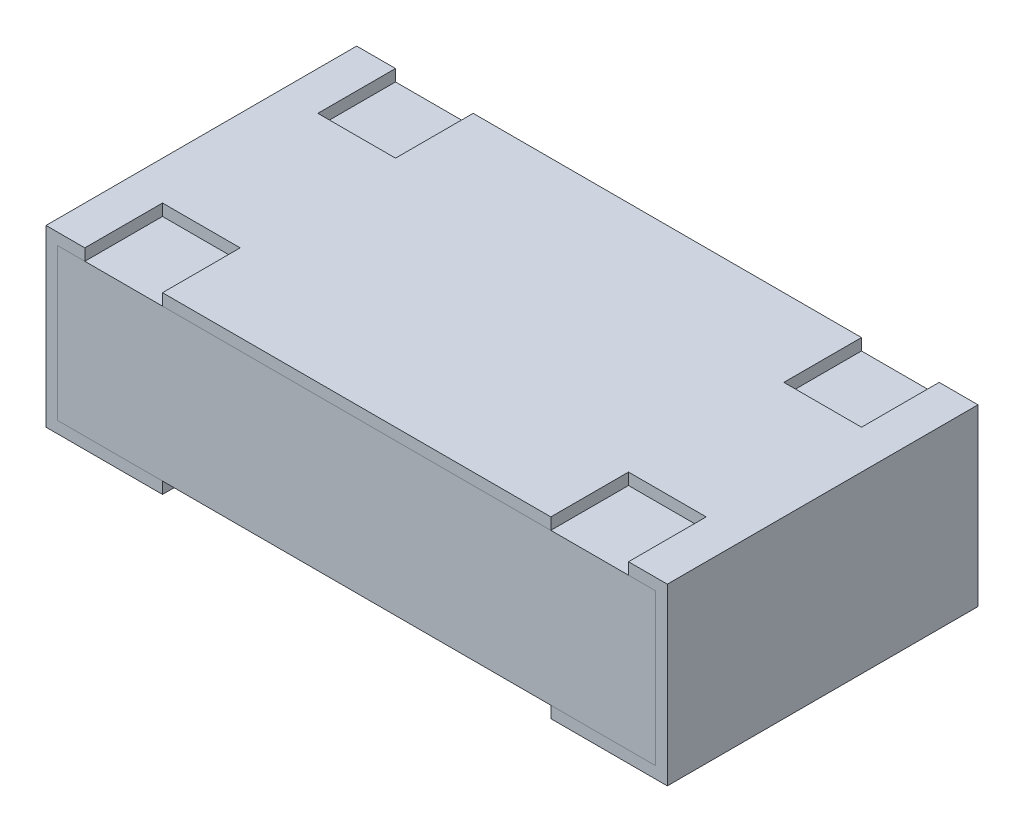
ISO-10303-21;
HEADER;
FILE_DESCRIPTION(('STEP AP214'),'2;1');
FILE_NAME('part.step','',(''),(''),'','','');
FILE_SCHEMA(('AUTOMOTIVE_DESIGN { 1 0 10303 214 1 1 1 1 }'));
ENDSEC;
DATA;
#1=APPLICATION_CONTEXT('core data for automotive mechanical design processes');
#2=APPLICATION_PROTOCOL_DEFINITION('international standard','automotive_design',2000,#1);
#3=PRODUCT_CONTEXT('',#1,'mechanical');
#4=PRODUCT('Part','Part','',(#3));
#5=PRODUCT_RELATED_PRODUCT_CATEGORY('part','',(#4));
#6=PRODUCT_DEFINITION_FORMATION('','',#4);
#7=PRODUCT_DEFINITION_CONTEXT('part definition',#1,'design');
#8=PRODUCT_DEFINITION('design','',#6,#7);
#9=PRODUCT_DEFINITION_SHAPE('','',#8);
#10=(LENGTH_UNIT() NAMED_UNIT(*) SI_UNIT(.MILLI.,.METRE.));
#11=(NAMED_UNIT(*) PLANE_ANGLE_UNIT() SI_UNIT($,.RADIAN.));
#12=(NAMED_UNIT(*) SI_UNIT($,.STERADIAN.) SOLID_ANGLE_UNIT());
#13=UNCERTAINTY_MEASURE_WITH_UNIT(LENGTH_MEASURE(1.E-05),#10,'distance_accuracy_value','');
#14=(GEOMETRIC_REPRESENTATION_CONTEXT(3) GLOBAL_UNCERTAINTY_ASSIGNED_CONTEXT((#13)) GLOBAL_UNIT_ASSIGNED_CONTEXT((#10,
#11,#12)) REPRESENTATION_CONTEXT('',''));
#15=CARTESIAN_POINT('',(0.,0.,0.));
#16=DIRECTION('',(0.,0.,1.));
#17=DIRECTION('',(1.,0.,0.));
#18=AXIS2_PLACEMENT_3D('',#15,#16,#17);
#19=CARTESIAN_POINT('',(0.77,0.42,0.));
#20=DIRECTION('',(0.,0.,1.));
#21=DIRECTION('',(1.,0.,0.));
#22=AXIS2_PLACEMENT_3D('',#19,#20,#21);
#23=PLANE('',#22);
#24=DIRECTION('',(0.,1.,0.));
#25=VECTOR('',#24,1.);
#26=CARTESIAN_POINT('',(0.77,0.03,0.));
#27=LINE('',#26,#25);
#28=CARTESIAN_POINT('',(0.77,0.03,0.));
#29=VERTEX_POINT('',#28);
#30=CARTESIAN_POINT('',(0.77,0.42,0.));
#31=VERTEX_POINT('',#30);
#32=EDGE_CURVE('P0_E93',#29,#31,#27,.T.);
#33=ORIENTED_EDGE('',*,*,#32,.F.);
#34=DIRECTION('',(1.,0.,0.));
#35=VECTOR('',#34,1.);
#36=CARTESIAN_POINT('',(0.77,0.03,0.));
#37=LINE('',#36,#35);
#38=CARTESIAN_POINT('',(-0.77,0.03,0.));
#39=VERTEX_POINT('',#38);
#40=EDGE_CURVE('P0_E20',#39,#29,#37,.T.);
#41=ORIENTED_EDGE('',*,*,#40,.F.);
#42=DIRECTION('',(0.,-1.,0.));
#43=VECTOR('',#42,1.);
#44=CARTESIAN_POINT('',(-0.77,0.03,0.));
#45=LINE('',#44,#43);
#46=CARTESIAN_POINT('',(-0.77,0.42,0.));
#47=VERTEX_POINT('',#46);
#48=EDGE_CURVE('P0_E82',#47,#39,#45,.T.);
#49=ORIENTED_EDGE('',*,*,#48,.F.);
#50=DIRECTION('',(-1.,0.,0.));
#51=VECTOR('',#50,1.);
#52=CARTESIAN_POINT('',(0.77,0.42,0.));
#53=LINE('',#52,#51);
#54=EDGE_CURVE('P0_E104',#31,#47,#53,.T.);
#55=ORIENTED_EDGE('',*,*,#54,.F.);
#56=EDGE_LOOP('',(#33,#41,#49,#55));
#57=FACE_BOUND('',#56,.T.);
#58=ADVANCED_FACE('P0_F17',(#57),#23,.F.);
#59=CARTESIAN_POINT('',(0.77,0.42,0.8));
#60=DIRECTION('',(0.,0.,1.));
#61=DIRECTION('',(1.,0.,0.));
#62=AXIS2_PLACEMENT_3D('',#59,#60,#61);
#63=PLANE('',#62);
#64=DIRECTION('',(0.,1.,0.));
#65=VECTOR('',#64,1.);
#66=CARTESIAN_POINT('',(0.77,0.03,0.8));
#67=LINE('',#66,#65);
#68=CARTESIAN_POINT('',(0.77,0.03,0.8));
#69=VERTEX_POINT('',#68);
#70=CARTESIAN_POINT('',(0.77,0.42,0.8));
#71=VERTEX_POINT('',#70);
#72=EDGE_CURVE('P0_E85',#69,#71,#67,.T.);
#73=ORIENTED_EDGE('',*,*,#72,.T.);
#74=DIRECTION('',(-1.,0.,0.));
#75=VECTOR('',#74,1.);
#76=CARTESIAN_POINT('',(0.77,0.42,0.8));
#77=LINE('',#76,#75);
#78=CARTESIAN_POINT('',(-0.77,0.42,0.8));
#79=VERTEX_POINT('',#78);
#80=EDGE_CURVE('P0_E71',#71,#79,#77,.T.);
#81=ORIENTED_EDGE('',*,*,#80,.T.);
#82=DIRECTION('',(0.,-1.,0.));
#83=VECTOR('',#82,1.);
#84=CARTESIAN_POINT('',(-0.77,0.03,0.8));
#85=LINE('',#84,#83);
#86=CARTESIAN_POINT('',(-0.77,0.03,0.8));
#87=VERTEX_POINT('',#86);
#88=EDGE_CURVE('P0_E113',#79,#87,#85,.T.);
#89=ORIENTED_EDGE('',*,*,#88,.T.);
#90=DIRECTION('',(1.,0.,0.));
#91=VECTOR('',#90,1.);
#92=CARTESIAN_POINT('',(0.77,0.03,0.8));
#93=LINE('',#92,#91);
#94=EDGE_CURVE('P0_E11',#87,#69,#93,.T.);
#95=ORIENTED_EDGE('',*,*,#94,.T.);
#96=EDGE_LOOP('',(#73,#81,#89,#95));
#97=FACE_BOUND('',#96,.T.);
#98=ADVANCED_FACE('P0_F86',(#97),#63,.T.);
#99=CARTESIAN_POINT('',(0.77,0.03,0.8));
#100=DIRECTION('',(0.,1.,0.));
#101=DIRECTION('',(1.,0.,0.));
#102=AXIS2_PLACEMENT_3D('',#99,#100,#101);
#103=PLANE('',#102);
#104=ORIENTED_EDGE('',*,*,#40,.T.);
#105=DIRECTION('',(0.,0.,-1.));
#106=VECTOR('',#105,1.);
#107=CARTESIAN_POINT('',(0.77,0.03,0.8));
#108=LINE('',#107,#106);
#109=EDGE_CURVE('P0_E90',#69,#29,#108,.T.);
#110=ORIENTED_EDGE('',*,*,#109,.F.);
#111=ORIENTED_EDGE('',*,*,#94,.F.);
#112=DIRECTION('',(0.,0.,-1.));
#113=VECTOR('',#112,1.);
#114=CARTESIAN_POINT('',(-0.77,0.03,0.8));
#115=LINE('',#114,#113);
#116=EDGE_CURVE('P0_E112',#87,#39,#115,.T.);
#117=ORIENTED_EDGE('',*,*,#116,.T.);
#118=EDGE_LOOP('',(#104,#110,#111,#117));
#119=FACE_BOUND('',#118,.T.);
#120=ADVANCED_FACE('P0_F119',(#119),#103,.F.);
#121=CARTESIAN_POINT('',(-0.77,0.03,0.8));
#122=DIRECTION('',(1.,0.,0.));
#123=DIRECTION('',(0.,1.,0.));
#124=AXIS2_PLACEMENT_3D('',#121,#122,#123);
#125=PLANE('',#124);
#126=ORIENTED_EDGE('',*,*,#48,.T.);
#127=ORIENTED_EDGE('',*,*,#116,.F.);
#128=ORIENTED_EDGE('',*,*,#88,.F.);
#129=DIRECTION('',(0.,0.,-1.));
#130=VECTOR('',#129,1.);
#131=CARTESIAN_POINT('',(-0.77,0.42,0.8));
#132=LINE('',#131,#130);
#133=EDGE_CURVE('P0_E79',#79,#47,#132,.T.);
#134=ORIENTED_EDGE('',*,*,#133,.T.);
#135=EDGE_LOOP('',(#126,#127,#128,#134));
#136=FACE_BOUND('',#135,.T.);
#137=ADVANCED_FACE('P0_F121',(#136),#125,.F.);
#138=CARTESIAN_POINT('',(0.77,0.42,0.8));
#139=DIRECTION('',(0.,-1.,0.));
#140=DIRECTION('',(0.,0.,-1.));
#141=AXIS2_PLACEMENT_3D('',#138,#139,#140);
#142=PLANE('',#141);
#143=ORIENTED_EDGE('',*,*,#54,.T.);
#144=ORIENTED_EDGE('',*,*,#133,.F.);
#145=ORIENTED_EDGE('',*,*,#80,.F.);
#146=DIRECTION('',(0.,0.,-1.));
#147=VECTOR('',#146,1.);
#148=CARTESIAN_POINT('',(0.77,0.42,0.8));
#149=LINE('',#148,#147);
#150=EDGE_CURVE('P0_E76',#71,#31,#149,.T.);
#151=ORIENTED_EDGE('',*,*,#150,.T.);
#152=EDGE_LOOP('',(#143,#144,#145,#151));
#153=FACE_BOUND('',#152,.T.);
#154=ADVANCED_FACE('P0_F74',(#153),#142,.F.);
#155=CARTESIAN_POINT('',(0.77,0.03,0.8));
#156=DIRECTION('',(-1.,0.,0.));
#157=DIRECTION('',(0.,0.,1.));
#158=AXIS2_PLACEMENT_3D('',#155,#156,#157);
#159=PLANE('',#158);
#160=ORIENTED_EDGE('',*,*,#32,.T.);
#161=ORIENTED_EDGE('',*,*,#150,.F.);
#162=ORIENTED_EDGE('',*,*,#72,.F.);
#163=ORIENTED_EDGE('',*,*,#109,.T.);
#164=EDGE_LOOP('',(#160,#161,#162,#163));
#165=FACE_BOUND('',#164,.T.);
#166=ADVANCED_FACE('P0_F92',(#165),#159,.F.);
#167=CLOSED_SHELL('',(#58,#98,#120,#137,#154,#166));
#168=MANIFOLD_SOLID_BREP('P0_B1',#167);
#169=CARTESIAN_POINT('',(0.7,0.42,0.6));
#170=DIRECTION('',(1.,0.,0.));
#171=DIRECTION('',(0.,1.,0.));
#172=AXIS2_PLACEMENT_3D('',#169,#170,#171);
#173=PLANE('',#172);
#174=DIRECTION('',(0.,0.,-1.));
#175=VECTOR('',#174,1.);
#176=CARTESIAN_POINT('',(0.7,0.45,0.6));
#177=LINE('',#176,#175);
#178=CARTESIAN_POINT('',(0.7,0.45,0.8));
#179=VERTEX_POINT('',#178);
#180=CARTESIAN_POINT('',(0.7,0.45,0.6));
#181=VERTEX_POINT('',#180);
#182=EDGE_CURVE('P1_E400',#179,#181,#177,.T.);
#183=ORIENTED_EDGE('',*,*,#182,.T.);
#184=DIRECTION('',(0.,1.,0.));
#185=VECTOR('',#184,1.);
#186=CARTESIAN_POINT('',(0.7,0.42,0.6));
#187=LINE('',#186,#185);
#188=CARTESIAN_POINT('',(0.7,0.42,0.6));
#189=VERTEX_POINT('',#188);
#190=EDGE_CURVE('P1_E11',#189,#181,#187,.T.);
#191=ORIENTED_EDGE('',*,*,#190,.F.);
#192=DIRECTION('',(0.,0.,-1.));
#193=VECTOR('',#192,1.);
#194=CARTESIAN_POINT('',(0.7,0.42,0.6));
#195=LINE('',#194,#193);
#196=CARTESIAN_POINT('',(0.7,0.42,0.8));
#197=VERTEX_POINT('',#196);
#198=EDGE_CURVE('P1_E347',#197,#189,#195,.T.);
#199=ORIENTED_EDGE('',*,*,#198,.F.);
#200=DIRECTION('',(0.,1.,0.));
#201=VECTOR('',#200,1.);
#202=CARTESIAN_POINT('',(0.7,0.42,0.8));
#203=LINE('',#202,#201);
#204=EDGE_CURVE('P1_E38',#197,#179,#203,.T.);
#205=ORIENTED_EDGE('',*,*,#204,.T.);
#206=EDGE_LOOP('',(#183,#191,#199,#205));
#207=FACE_BOUND('',#206,.T.);
#208=ADVANCED_FACE('P1_F17',(#207),#173,.F.);
#209=CARTESIAN_POINT('',(0.5,0.42,0.6));
#210=DIRECTION('',(0.,0.,-1.));
#211=DIRECTION('',(0.,-1.,0.));
#212=AXIS2_PLACEMENT_3D('',#209,#210,#211);
#213=PLANE('',#212);
#214=DIRECTION('',(-1.,0.,0.));
#215=VECTOR('',#214,1.);
#216=CARTESIAN_POINT('',(0.5,0.45,0.6));
#217=LINE('',#216,#215);
#218=CARTESIAN_POINT('',(0.5,0.45,0.6));
#219=VERTEX_POINT('',#218);
#220=EDGE_CURVE('P1_E396',#181,#219,#217,.T.);
#221=ORIENTED_EDGE('',*,*,#220,.T.);
#222=DIRECTION('',(0.,1.,0.));
#223=VECTOR('',#222,1.);
#224=CARTESIAN_POINT('',(0.5,0.42,0.6));
#225=LINE('',#224,#223);
#226=CARTESIAN_POINT('',(0.5,0.42,0.6));
#227=VERTEX_POINT('',#226);
#228=EDGE_CURVE('P1_E26',#227,#219,#225,.T.);
#229=ORIENTED_EDGE('',*,*,#228,.F.);
#230=DIRECTION('',(-1.,0.,0.));
#231=VECTOR('',#230,1.);
#232=CARTESIAN_POINT('',(0.5,0.42,0.6));
#233=LINE('',#232,#231);
#234=EDGE_CURVE('P1_E352',#189,#227,#233,.T.);
#235=ORIENTED_EDGE('',*,*,#234,.F.);
#236=ORIENTED_EDGE('',*,*,#190,.T.);
#237=EDGE_LOOP('',(#221,#229,#235,#236));
#238=FACE_BOUND('',#237,.T.);
#239=ADVANCED_FACE('P1_F438',(#238),#213,.F.);
#240=CARTESIAN_POINT('',(0.5,0.42,0.8));
#241=DIRECTION('',(-1.,0.,0.));
#242=DIRECTION('',(0.,0.,1.));
#243=AXIS2_PLACEMENT_3D('',#240,#241,#242);
#244=PLANE('',#243);
#245=DIRECTION('',(0.,0.,1.));
#246=VECTOR('',#245,1.);
#247=CARTESIAN_POINT('',(0.5,0.45,0.8));
#248=LINE('',#247,#246);
#249=CARTESIAN_POINT('',(0.5,0.45,0.8));
#250=VERTEX_POINT('',#249);
#251=EDGE_CURVE('P1_E433',#219,#250,#248,.T.);
#252=ORIENTED_EDGE('',*,*,#251,.T.);
#253=DIRECTION('',(0.,1.,0.));
#254=VECTOR('',#253,1.);
#255=CARTESIAN_POINT('',(0.5,0.42,0.8));
#256=LINE('',#255,#254);
#257=CARTESIAN_POINT('',(0.5,0.42,0.8));
#258=VERTEX_POINT('',#257);
#259=EDGE_CURVE('P1_E516',#258,#250,#256,.T.);
#260=ORIENTED_EDGE('',*,*,#259,.F.);
#261=DIRECTION('',(0.,0.,1.));
#262=VECTOR('',#261,1.);
#263=CARTESIAN_POINT('',(0.5,0.42,0.8));
#264=LINE('',#263,#262);
#265=EDGE_CURVE('P1_E356',#227,#258,#264,.T.);
#266=ORIENTED_EDGE('',*,*,#265,.F.);
#267=ORIENTED_EDGE('',*,*,#228,.T.);
#268=EDGE_LOOP('',(#252,#260,#266,#267));
#269=FACE_BOUND('',#268,.T.);
#270=ADVANCED_FACE('P1_F430',(#269),#244,.F.);
#271=CARTESIAN_POINT('',(-0.5,0.42,0.8));
#272=DIRECTION('',(1.,0.,0.));
#273=DIRECTION('',(0.,1.,0.));
#274=AXIS2_PLACEMENT_3D('',#271,#272,#273);
#275=PLANE('',#274);
#276=DIRECTION('',(0.,0.,-1.));
#277=VECTOR('',#276,1.);
#278=CARTESIAN_POINT('',(-0.5,0.45,0.8));
#279=LINE('',#278,#277);
#280=CARTESIAN_POINT('',(-0.5,0.45,0.8));
#281=VERTEX_POINT('',#280);
#282=CARTESIAN_POINT('',(-0.5,0.45,0.6));
#283=VERTEX_POINT('',#282);
#284=EDGE_CURVE('P1_E455',#281,#283,#279,.T.);
#285=ORIENTED_EDGE('',*,*,#284,.T.);
#286=DIRECTION('',(0.,1.,0.));
#287=VECTOR('',#286,1.);
#288=CARTESIAN_POINT('',(-0.5,0.42,0.6));
#289=LINE('',#288,#287);
#290=CARTESIAN_POINT('',(-0.5,0.42,0.6));
#291=VERTEX_POINT('',#290);
#292=EDGE_CURVE('P1_E422',#291,#283,#289,.T.);
#293=ORIENTED_EDGE('',*,*,#292,.F.);
#294=DIRECTION('',(0.,0.,-1.));
#295=VECTOR('',#294,1.);
#296=CARTESIAN_POINT('',(-0.5,0.42,0.8));
#297=LINE('',#296,#295);
#298=CARTESIAN_POINT('',(-0.5,0.42,0.8));
#299=VERTEX_POINT('',#298);
#300=EDGE_CURVE('P1_E359',#299,#291,#297,.T.);
#301=ORIENTED_EDGE('',*,*,#300,.F.);
#302=DIRECTION('',(0.,1.,0.));
#303=VECTOR('',#302,1.);
#304=CARTESIAN_POINT('',(-0.5,0.42,0.8));
#305=LINE('',#304,#303);
#306=EDGE_CURVE('P1_E519',#299,#281,#305,.T.);
#307=ORIENTED_EDGE('',*,*,#306,.T.);
#308=EDGE_LOOP('',(#285,#293,#301,#307));
#309=FACE_BOUND('',#308,.T.);
#310=ADVANCED_FACE('P1_F651',(#309),#275,.F.);
#311=CARTESIAN_POINT('',(-0.5,0.42,0.6));
#312=DIRECTION('',(0.,0.,-1.));
#313=DIRECTION('',(0.,-1.,0.));
#314=AXIS2_PLACEMENT_3D('',#311,#312,#313);
#315=PLANE('',#314);
#316=DIRECTION('',(-1.,0.,0.));
#317=VECTOR('',#316,1.);
#318=CARTESIAN_POINT('',(-0.5,0.45,0.6));
#319=LINE('',#318,#317);
#320=CARTESIAN_POINT('',(-0.7,0.45,0.6));
#321=VERTEX_POINT('',#320);
#322=EDGE_CURVE('P1_E475',#283,#321,#319,.T.);
#323=ORIENTED_EDGE('',*,*,#322,.T.);
#324=DIRECTION('',(0.,1.,0.));
#325=VECTOR('',#324,1.);
#326=CARTESIAN_POINT('',(-0.7,0.42,0.6));
#327=LINE('',#326,#325);
#328=CARTESIAN_POINT('',(-0.7,0.42,0.6));
#329=VERTEX_POINT('',#328);
#330=EDGE_CURVE('P1_E421',#329,#321,#327,.T.);
#331=ORIENTED_EDGE('',*,*,#330,.F.);
#332=DIRECTION('',(-1.,0.,0.));
#333=VECTOR('',#332,1.);
#334=CARTESIAN_POINT('',(-0.5,0.42,0.6));
#335=LINE('',#334,#333);
#336=EDGE_CURVE('P1_E363',#291,#329,#335,.T.);
#337=ORIENTED_EDGE('',*,*,#336,.F.);
#338=ORIENTED_EDGE('',*,*,#292,.T.);
#339=EDGE_LOOP('',(#323,#331,#337,#338));
#340=FACE_BOUND('',#339,.T.);
#341=ADVANCED_FACE('P1_F649',(#340),#315,.F.);
#342=CARTESIAN_POINT('',(-0.7,0.42,0.6));
#343=DIRECTION('',(-1.,0.,0.));
#344=DIRECTION('',(0.,0.,1.));
#345=AXIS2_PLACEMENT_3D('',#342,#343,#344);
#346=PLANE('',#345);
#347=DIRECTION('',(0.,0.,1.));
#348=VECTOR('',#347,1.);
#349=CARTESIAN_POINT('',(-0.7,0.45,0.6));
#350=LINE('',#349,#348);
#351=CARTESIAN_POINT('',(-0.7,0.45,0.8));
#352=VERTEX_POINT('',#351);
#353=EDGE_CURVE('P1_E472',#321,#352,#350,.T.);
#354=ORIENTED_EDGE('',*,*,#353,.T.);
#355=DIRECTION('',(0.,1.,0.));
#356=VECTOR('',#355,1.);
#357=CARTESIAN_POINT('',(-0.7,0.42,0.8));
#358=LINE('',#357,#356);
#359=CARTESIAN_POINT('',(-0.7,0.42,0.8));
#360=VERTEX_POINT('',#359);
#361=EDGE_CURVE('P1_E505',#360,#352,#358,.T.);
#362=ORIENTED_EDGE('',*,*,#361,.F.);
#363=DIRECTION('',(0.,0.,1.));
#364=VECTOR('',#363,1.);
#365=CARTESIAN_POINT('',(-0.7,0.42,0.6));
#366=LINE('',#365,#364);
#367=EDGE_CURVE('P1_E489',#329,#360,#366,.T.);
#368=ORIENTED_EDGE('',*,*,#367,.F.);
#369=ORIENTED_EDGE('',*,*,#330,.T.);
#370=EDGE_LOOP('',(#354,#362,#368,#369));
#371=FACE_BOUND('',#370,.T.);
#372=ADVANCED_FACE('P1_F646',(#371),#346,.F.);
#373=CARTESIAN_POINT('',(-0.7,0.42,0.2));
#374=DIRECTION('',(-1.,0.,0.));
#375=DIRECTION('',(0.,0.,1.));
#376=AXIS2_PLACEMENT_3D('',#373,#374,#375);
#377=PLANE('',#376);
#378=DIRECTION('',(0.,0.,1.));
#379=VECTOR('',#378,1.);
#380=CARTESIAN_POINT('',(-0.7,0.45,0.2));
#381=LINE('',#380,#379);
#382=CARTESIAN_POINT('',(-0.7,0.45,0.));
#383=VERTEX_POINT('',#382);
#384=CARTESIAN_POINT('',(-0.7,0.45,0.2));
#385=VERTEX_POINT('',#384);
#386=EDGE_CURVE('P1_E453',#383,#385,#381,.T.);
#387=ORIENTED_EDGE('',*,*,#386,.T.);
#388=DIRECTION('',(0.,1.,0.));
#389=VECTOR('',#388,1.);
#390=CARTESIAN_POINT('',(-0.7,0.42,0.2));
#391=LINE('',#390,#389);
#392=CARTESIAN_POINT('',(-0.7,0.42,0.2));
#393=VERTEX_POINT('',#392);
#394=EDGE_CURVE('P1_E418',#393,#385,#391,.T.);
#395=ORIENTED_EDGE('',*,*,#394,.F.);
#396=DIRECTION('',(0.,0.,1.));
#397=VECTOR('',#396,1.);
#398=CARTESIAN_POINT('',(-0.7,0.42,0.2));
#399=LINE('',#398,#397);
#400=CARTESIAN_POINT('',(-0.7,0.42,0.));
#401=VERTEX_POINT('',#400);
#402=EDGE_CURVE('P1_E364',#401,#393,#399,.T.);
#403=ORIENTED_EDGE('',*,*,#402,.F.);
#404=DIRECTION('',(0.,1.,0.));
#405=VECTOR('',#404,1.);
#406=CARTESIAN_POINT('',(-0.7,0.42,0.));
#407=LINE('',#406,#405);
#408=EDGE_CURVE('P1_E407',#401,#383,#407,.T.);
#409=ORIENTED_EDGE('',*,*,#408,.T.);
#410=EDGE_LOOP('',(#387,#395,#403,#409));
#411=FACE_BOUND('',#410,.T.);
#412=ADVANCED_FACE('P1_F640',(#411),#377,.F.);
#413=CARTESIAN_POINT('',(-0.5,0.42,0.2));
#414=DIRECTION('',(0.,0.,1.));
#415=DIRECTION('',(1.,0.,0.));
#416=AXIS2_PLACEMENT_3D('',#413,#414,#415);
#417=PLANE('',#416);
#418=DIRECTION('',(1.,0.,0.));
#419=VECTOR('',#418,1.);
#420=CARTESIAN_POINT('',(-0.5,0.45,0.2));
#421=LINE('',#420,#419);
#422=CARTESIAN_POINT('',(-0.5,0.45,0.2));
#423=VERTEX_POINT('',#422);
#424=EDGE_CURVE('P1_E446',#385,#423,#421,.T.);
#425=ORIENTED_EDGE('',*,*,#424,.T.);
#426=DIRECTION('',(0.,1.,0.));
#427=VECTOR('',#426,1.);
#428=CARTESIAN_POINT('',(-0.5,0.42,0.2));
#429=LINE('',#428,#427);
#430=CARTESIAN_POINT('',(-0.5,0.42,0.2));
#431=VERTEX_POINT('',#430);
#432=EDGE_CURVE('P1_E417',#431,#423,#429,.T.);
#433=ORIENTED_EDGE('',*,*,#432,.F.);
#434=DIRECTION('',(1.,0.,0.));
#435=VECTOR('',#434,1.);
#436=CARTESIAN_POINT('',(-0.5,0.42,0.2));
#437=LINE('',#436,#435);
#438=EDGE_CURVE('P1_E338',#393,#431,#437,.T.);
#439=ORIENTED_EDGE('',*,*,#438,.F.);
#440=ORIENTED_EDGE('',*,*,#394,.T.);
#441=EDGE_LOOP('',(#425,#433,#439,#440));
#442=FACE_BOUND('',#441,.T.);
#443=ADVANCED_FACE('P1_F627',(#442),#417,.F.);
#444=CARTESIAN_POINT('',(-0.5,0.42,0.));
#445=DIRECTION('',(1.,0.,0.));
#446=DIRECTION('',(0.,1.,0.));
#447=AXIS2_PLACEMENT_3D('',#444,#445,#446);
#448=PLANE('',#447);
#449=DIRECTION('',(0.,0.,-1.));
#450=VECTOR('',#449,1.);
#451=CARTESIAN_POINT('',(-0.5,0.45,0.));
#452=LINE('',#451,#450);
#453=CARTESIAN_POINT('',(-0.5,0.45,0.));
#454=VERTEX_POINT('',#453);
#455=EDGE_CURVE('P1_E468',#423,#454,#452,.T.);
#456=ORIENTED_EDGE('',*,*,#455,.T.);
#457=DIRECTION('',(0.,1.,0.));
#458=VECTOR('',#457,1.);
#459=CARTESIAN_POINT('',(-0.5,0.42,0.));
#460=LINE('',#459,#458);
#461=CARTESIAN_POINT('',(-0.5,0.42,0.));
#462=VERTEX_POINT('',#461);
#463=EDGE_CURVE('P1_E306',#462,#454,#460,.T.);
#464=ORIENTED_EDGE('',*,*,#463,.F.);
#465=DIRECTION('',(0.,0.,-1.));
#466=VECTOR('',#465,1.);
#467=CARTESIAN_POINT('',(-0.5,0.42,0.));
#468=LINE('',#467,#466);
#469=EDGE_CURVE('P1_E316',#431,#462,#468,.T.);
#470=ORIENTED_EDGE('',*,*,#469,.F.);
#471=ORIENTED_EDGE('',*,*,#432,.T.);
#472=EDGE_LOOP('',(#456,#464,#470,#471));
#473=FACE_BOUND('',#472,.T.);
#474=ADVANCED_FACE('P1_F621',(#473),#448,.F.);
#475=CARTESIAN_POINT('',(0.5,0.42,0.));
#476=DIRECTION('',(-1.,0.,0.));
#477=DIRECTION('',(0.,0.,1.));
#478=AXIS2_PLACEMENT_3D('',#475,#476,#477);
#479=PLANE('',#478);
#480=DIRECTION('',(0.,0.,1.));
#481=VECTOR('',#480,1.);
#482=CARTESIAN_POINT('',(0.5,0.45,0.));
#483=LINE('',#482,#481);
#484=CARTESIAN_POINT('',(0.5,0.45,0.));
#485=VERTEX_POINT('',#484);
#486=CARTESIAN_POINT('',(0.5,0.45,0.2));
#487=VERTEX_POINT('',#486);
#488=EDGE_CURVE('P1_E460',#485,#487,#483,.T.);
#489=ORIENTED_EDGE('',*,*,#488,.T.);
#490=DIRECTION('',(0.,1.,0.));
#491=VECTOR('',#490,1.);
#492=CARTESIAN_POINT('',(0.5,0.42,0.2));
#493=LINE('',#492,#491);
#494=CARTESIAN_POINT('',(0.5,0.42,0.2));
#495=VERTEX_POINT('',#494);
#496=EDGE_CURVE('P1_E414',#495,#487,#493,.T.);
#497=ORIENTED_EDGE('',*,*,#496,.F.);
#498=DIRECTION('',(0.,0.,1.));
#499=VECTOR('',#498,1.);
#500=CARTESIAN_POINT('',(0.5,0.42,0.));
#501=LINE('',#500,#499);
#502=CARTESIAN_POINT('',(0.5,0.42,0.));
#503=VERTEX_POINT('',#502);
#504=EDGE_CURVE('P1_E312',#503,#495,#501,.T.);
#505=ORIENTED_EDGE('',*,*,#504,.F.);
#506=DIRECTION('',(0.,1.,0.));
#507=VECTOR('',#506,1.);
#508=CARTESIAN_POINT('',(0.5,0.42,0.));
#509=LINE('',#508,#507);
#510=EDGE_CURVE('P1_E302',#503,#485,#509,.T.);
#511=ORIENTED_EDGE('',*,*,#510,.T.);
#512=EDGE_LOOP('',(#489,#497,#505,#511));
#513=FACE_BOUND('',#512,.T.);
#514=ADVANCED_FACE('P1_F937',(#513),#479,.F.);
#515=CARTESIAN_POINT('',(0.5,0.42,0.2));
#516=DIRECTION('',(0.,0.,1.));
#517=DIRECTION('',(1.,0.,0.));
#518=AXIS2_PLACEMENT_3D('',#515,#516,#517);
#519=PLANE('',#518);
#520=DIRECTION('',(1.,0.,0.));
#521=VECTOR('',#520,1.);
#522=CARTESIAN_POINT('',(0.5,0.45,0.2));
#523=LINE('',#522,#521);
#524=CARTESIAN_POINT('',(0.7,0.45,0.2));
#525=VERTEX_POINT('',#524);
#526=EDGE_CURVE('P1_E392',#487,#525,#523,.T.);
#527=ORIENTED_EDGE('',*,*,#526,.T.);
#528=DIRECTION('',(0.,1.,0.));
#529=VECTOR('',#528,1.);
#530=CARTESIAN_POINT('',(0.7,0.42,0.2));
#531=LINE('',#530,#529);
#532=CARTESIAN_POINT('',(0.7,0.42,0.2));
#533=VERTEX_POINT('',#532);
#534=EDGE_CURVE('P1_E410',#533,#525,#531,.T.);
#535=ORIENTED_EDGE('',*,*,#534,.F.);
#536=DIRECTION('',(1.,0.,0.));
#537=VECTOR('',#536,1.);
#538=CARTESIAN_POINT('',(0.5,0.42,0.2));
#539=LINE('',#538,#537);
#540=EDGE_CURVE('P1_E315',#495,#533,#539,.T.);
#541=ORIENTED_EDGE('',*,*,#540,.F.);
#542=ORIENTED_EDGE('',*,*,#496,.T.);
#543=EDGE_LOOP('',(#527,#535,#541,#542));
#544=FACE_BOUND('',#543,.T.);
#545=ADVANCED_FACE('P1_F932',(#544),#519,.F.);
#546=CARTESIAN_POINT('',(0.7,0.42,0.2));
#547=DIRECTION('',(1.,0.,0.));
#548=DIRECTION('',(0.,1.,0.));
#549=AXIS2_PLACEMENT_3D('',#546,#547,#548);
#550=PLANE('',#549);
#551=DIRECTION('',(0.,0.,-1.));
#552=VECTOR('',#551,1.);
#553=CARTESIAN_POINT('',(0.7,0.45,0.2));
#554=LINE('',#553,#552);
#555=CARTESIAN_POINT('',(0.7,0.45,0.));
#556=VERTEX_POINT('',#555);
#557=EDGE_CURVE('P1_E401',#525,#556,#554,.T.);
#558=ORIENTED_EDGE('',*,*,#557,.T.);
#559=DIRECTION('',(0.,1.,0.));
#560=VECTOR('',#559,1.);
#561=CARTESIAN_POINT('',(0.7,0.42,0.));
#562=LINE('',#561,#560);
#563=CARTESIAN_POINT('',(0.7,0.42,0.));
#564=VERTEX_POINT('',#563);
#565=EDGE_CURVE('P1_E307',#564,#556,#562,.T.);
#566=ORIENTED_EDGE('',*,*,#565,.F.);
#567=DIRECTION('',(0.,0.,-1.));
#568=VECTOR('',#567,1.);
#569=CARTESIAN_POINT('',(0.7,0.42,0.2));
#570=LINE('',#569,#568);
#571=EDGE_CURVE('P1_E526',#533,#564,#570,.T.);
#572=ORIENTED_EDGE('',*,*,#571,.F.);
#573=ORIENTED_EDGE('',*,*,#534,.T.);
#574=EDGE_LOOP('',(#558,#566,#572,#573));
#575=FACE_BOUND('',#574,.T.);
#576=ADVANCED_FACE('P1_F905',(#575),#550,.F.);
#577=CARTESIAN_POINT('',(-0.8,0.45,0.));
#578=DIRECTION('',(0.,0.,1.));
#579=DIRECTION('',(1.,0.,0.));
#580=AXIS2_PLACEMENT_3D('',#577,#578,#579);
#581=PLANE('',#580);
#582=DIRECTION('',(-1.,0.,0.));
#583=VECTOR('',#582,1.);
#584=CARTESIAN_POINT('',(0.,0.45,0.));
#585=LINE('',#584,#583);
#586=CARTESIAN_POINT('',(-0.8,0.45,0.));
#587=VERTEX_POINT('',#586);
#588=EDGE_CURVE('P1_E481',#383,#587,#585,.T.);
#589=ORIENTED_EDGE('',*,*,#588,.F.);
#590=ORIENTED_EDGE('',*,*,#408,.F.);
#591=DIRECTION('',(1.,0.,0.));
#592=VECTOR('',#591,1.);
#593=CARTESIAN_POINT('',(0.,0.42,0.));
#594=LINE('',#593,#592);
#595=CARTESIAN_POINT('',(-0.77,0.42,0.));
#596=VERTEX_POINT('',#595);
#597=EDGE_CURVE('P1_E368',#596,#401,#594,.T.);
#598=ORIENTED_EDGE('',*,*,#597,.F.);
#599=DIRECTION('',(0.,1.,0.));
#600=VECTOR('',#599,1.);
#601=CARTESIAN_POINT('',(-0.77,0.42,0.));
#602=LINE('',#601,#600);
#603=CARTESIAN_POINT('',(-0.77,0.03,0.));
#604=VERTEX_POINT('',#603);
#605=EDGE_CURVE('P1_E339',#604,#596,#602,.T.);
#606=ORIENTED_EDGE('',*,*,#605,.F.);
#607=DIRECTION('',(-1.,0.,0.));
#608=VECTOR('',#607,1.);
#609=CARTESIAN_POINT('',(-0.77,0.03,0.));
#610=LINE('',#609,#608);
#611=CARTESIAN_POINT('',(-0.5,0.03,0.));
#612=VERTEX_POINT('',#611);
#613=EDGE_CURVE('P1_E574',#612,#604,#610,.T.);
#614=ORIENTED_EDGE('',*,*,#613,.F.);
#615=DIRECTION('',(0.,1.,0.));
#616=VECTOR('',#615,1.);
#617=CARTESIAN_POINT('',(-0.5,0.03,0.));
#618=LINE('',#617,#616);
#619=CARTESIAN_POINT('',(-0.5,0.,0.));
#620=VERTEX_POINT('',#619);
#621=EDGE_CURVE('P1_E333',#620,#612,#618,.T.);
#622=ORIENTED_EDGE('',*,*,#621,.F.);
#623=DIRECTION('',(1.,0.,0.));
#624=VECTOR('',#623,1.);
#625=CARTESIAN_POINT('',(-0.8,0.,0.));
#626=LINE('',#625,#624);
#627=CARTESIAN_POINT('',(-0.8,0.,0.));
#628=VERTEX_POINT('',#627);
#629=EDGE_CURVE('P1_E325',#628,#620,#626,.T.);
#630=ORIENTED_EDGE('',*,*,#629,.F.);
#631=DIRECTION('',(0.,-1.,0.));
#632=VECTOR('',#631,1.);
#633=CARTESIAN_POINT('',(-0.8,0.45,0.));
#634=LINE('',#633,#632);
#635=EDGE_CURVE('P1_E320',#587,#628,#634,.T.);
#636=ORIENTED_EDGE('',*,*,#635,.F.);
#637=EDGE_LOOP('',(#589,#590,#598,#606,#614,#622,#630,#636));
#638=FACE_BOUND('',#637,.T.);
#639=ADVANCED_FACE('P1_F592',(#638),#581,.F.);
#640=CARTESIAN_POINT('',(-0.8,0.45,0.8));
#641=DIRECTION('',(0.,0.,1.));
#642=DIRECTION('',(1.,0.,0.));
#643=AXIS2_PLACEMENT_3D('',#640,#641,#642);
#644=PLANE('',#643);
#645=ORIENTED_EDGE('',*,*,#204,.F.);
#646=DIRECTION('',(1.,0.,0.));
#647=VECTOR('',#646,1.);
#648=CARTESIAN_POINT('',(0.,0.42,0.8));
#649=LINE('',#648,#647);
#650=CARTESIAN_POINT('',(0.77,0.42,0.8));
#651=VERTEX_POINT('',#650);
#652=EDGE_CURVE('P1_E343',#197,#651,#649,.T.);
#653=ORIENTED_EDGE('',*,*,#652,.T.);
#654=DIRECTION('',(0.,-1.,0.));
#655=VECTOR('',#654,1.);
#656=CARTESIAN_POINT('',(0.77,0.42,0.8));
#657=LINE('',#656,#655);
#658=CARTESIAN_POINT('',(0.77,0.03,0.8));
#659=VERTEX_POINT('',#658);
#660=EDGE_CURVE('P1_E272',#651,#659,#657,.T.);
#661=ORIENTED_EDGE('',*,*,#660,.T.);
#662=DIRECTION('',(-1.,0.,0.));
#663=VECTOR('',#662,1.);
#664=CARTESIAN_POINT('',(0.77,0.03,0.8));
#665=LINE('',#664,#663);
#666=CARTESIAN_POINT('',(0.5,0.03,0.8));
#667=VERTEX_POINT('',#666);
#668=EDGE_CURVE('P1_E271',#659,#667,#665,.T.);
#669=ORIENTED_EDGE('',*,*,#668,.T.);
#670=DIRECTION('',(0.,-1.,0.));
#671=VECTOR('',#670,1.);
#672=CARTESIAN_POINT('',(0.5,0.03,0.8));
#673=LINE('',#672,#671);
#674=CARTESIAN_POINT('',(0.5,0.,0.8));
#675=VERTEX_POINT('',#674);
#676=EDGE_CURVE('P1_E244',#667,#675,#673,.T.);
#677=ORIENTED_EDGE('',*,*,#676,.T.);
#678=DIRECTION('',(1.,0.,0.));
#679=VECTOR('',#678,1.);
#680=CARTESIAN_POINT('',(0.8,0.,0.8));
#681=LINE('',#680,#679);
#682=CARTESIAN_POINT('',(0.8,0.,0.8));
#683=VERTEX_POINT('',#682);
#684=EDGE_CURVE('P1_E233',#675,#683,#681,.T.);
#685=ORIENTED_EDGE('',*,*,#684,.T.);
#686=DIRECTION('',(0.,1.,0.));
#687=VECTOR('',#686,1.);
#688=CARTESIAN_POINT('',(0.8,0.45,0.8));
#689=LINE('',#688,#687);
#690=CARTESIAN_POINT('',(0.8,0.45,0.8));
#691=VERTEX_POINT('',#690);
#692=EDGE_CURVE('P1_E388',#683,#691,#689,.T.);
#693=ORIENTED_EDGE('',*,*,#692,.T.);
#694=DIRECTION('',(-1.,0.,0.));
#695=VECTOR('',#694,1.);
#696=CARTESIAN_POINT('',(0.,0.45,0.8));
#697=LINE('',#696,#695);
#698=EDGE_CURVE('P1_E404',#691,#179,#697,.T.);
#699=ORIENTED_EDGE('',*,*,#698,.T.);
#700=EDGE_LOOP('',(#645,#653,#661,#669,#677,#685,#693,#699));
#701=FACE_BOUND('',#700,.T.);
#702=ADVANCED_FACE('P1_F904',(#701),#644,.T.);
#703=CARTESIAN_POINT('',(0.8,0.45,0.8));
#704=DIRECTION('',(-1.,0.,0.));
#705=DIRECTION('',(0.,0.,1.));
#706=AXIS2_PLACEMENT_3D('',#703,#704,#705);
#707=PLANE('',#706);
#708=DIRECTION('',(0.,1.,0.));
#709=VECTOR('',#708,1.);
#710=CARTESIAN_POINT('',(0.8,0.45,0.));
#711=LINE('',#710,#709);
#712=CARTESIAN_POINT('',(0.8,0.,0.));
#713=VERTEX_POINT('',#712);
#714=CARTESIAN_POINT('',(0.8,0.45,0.));
#715=VERTEX_POINT('',#714);
#716=EDGE_CURVE('P1_E296',#713,#715,#711,.T.);
#717=ORIENTED_EDGE('',*,*,#716,.T.);
#718=DIRECTION('',(0.,0.,-1.));
#719=VECTOR('',#718,1.);
#720=CARTESIAN_POINT('',(0.8,0.45,0.8));
#721=LINE('',#720,#719);
#722=EDGE_CURVE('P1_E384',#691,#715,#721,.T.);
#723=ORIENTED_EDGE('',*,*,#722,.F.);
#724=ORIENTED_EDGE('',*,*,#692,.F.);
#725=DIRECTION('',(0.,0.,-1.));
#726=VECTOR('',#725,1.);
#727=CARTESIAN_POINT('',(0.8,0.,0.8));
#728=LINE('',#727,#726);
#729=EDGE_CURVE('P1_E381',#683,#713,#728,.T.);
#730=ORIENTED_EDGE('',*,*,#729,.T.);
#731=EDGE_LOOP('',(#717,#723,#724,#730));
#732=FACE_BOUND('',#731,.T.);
#733=ADVANCED_FACE('P1_F1061',(#732),#707,.F.);
#734=CARTESIAN_POINT('',(0.8,0.,0.8));
#735=DIRECTION('',(0.,1.,0.));
#736=DIRECTION('',(1.,0.,0.));
#737=AXIS2_PLACEMENT_3D('',#734,#735,#736);
#738=PLANE('',#737);
#739=DIRECTION('',(1.,0.,0.));
#740=VECTOR('',#739,1.);
#741=CARTESIAN_POINT('',(0.8,0.,0.));
#742=LINE('',#741,#740);
#743=CARTESIAN_POINT('',(0.5,0.,0.));
#744=VERTEX_POINT('',#743);
#745=EDGE_CURVE('P1_E289',#744,#713,#742,.T.);
#746=ORIENTED_EDGE('',*,*,#745,.T.);
#747=ORIENTED_EDGE('',*,*,#729,.F.);
#748=ORIENTED_EDGE('',*,*,#684,.F.);
#749=DIRECTION('',(0.,0.,-1.));
#750=VECTOR('',#749,1.);
#751=CARTESIAN_POINT('',(0.5,0.,0.8));
#752=LINE('',#751,#750);
#753=EDGE_CURVE('P1_E376',#675,#744,#752,.T.);
#754=ORIENTED_EDGE('',*,*,#753,.T.);
#755=EDGE_LOOP('',(#746,#747,#748,#754));
#756=FACE_BOUND('',#755,.T.);
#757=ADVANCED_FACE('P1_F1052',(#756),#738,.F.);
#758=CARTESIAN_POINT('',(0.5,0.03,0.8));
#759=DIRECTION('',(1.,0.,0.));
#760=DIRECTION('',(0.,1.,0.));
#761=AXIS2_PLACEMENT_3D('',#758,#759,#760);
#762=PLANE('',#761);
#763=DIRECTION('',(0.,-1.,0.));
#764=VECTOR('',#763,1.);
#765=CARTESIAN_POINT('',(0.5,0.03,0.));
#766=LINE('',#765,#764);
#767=CARTESIAN_POINT('',(0.5,0.03,0.));
#768=VERTEX_POINT('',#767);
#769=EDGE_CURVE('P1_E267',#768,#744,#766,.T.);
#770=ORIENTED_EDGE('',*,*,#769,.T.);
#771=ORIENTED_EDGE('',*,*,#753,.F.);
#772=ORIENTED_EDGE('',*,*,#676,.F.);
#773=DIRECTION('',(0.,0.,-1.));
#774=VECTOR('',#773,1.);
#775=CARTESIAN_POINT('',(0.5,0.03,0.8));
#776=LINE('',#775,#774);
#777=EDGE_CURVE('P1_E263',#667,#768,#776,.T.);
#778=ORIENTED_EDGE('',*,*,#777,.T.);
#779=EDGE_LOOP('',(#770,#771,#772,#778));
#780=FACE_BOUND('',#779,.T.);
#781=ADVANCED_FACE('P1_F265',(#780),#762,.F.);
#782=CARTESIAN_POINT('',(0.77,0.03,0.8));
#783=DIRECTION('',(0.,-1.,0.));
#784=DIRECTION('',(0.,0.,-1.));
#785=AXIS2_PLACEMENT_3D('',#782,#783,#784);
#786=PLANE('',#785);
#787=DIRECTION('',(-1.,0.,0.));
#788=VECTOR('',#787,1.);
#789=CARTESIAN_POINT('',(0.77,0.03,0.));
#790=LINE('',#789,#788);
#791=CARTESIAN_POINT('',(0.77,0.03,0.));
#792=VERTEX_POINT('',#791);
#793=EDGE_CURVE('P1_E275',#792,#768,#790,.T.);
#794=ORIENTED_EDGE('',*,*,#793,.T.);
#795=ORIENTED_EDGE('',*,*,#777,.F.);
#796=ORIENTED_EDGE('',*,*,#668,.F.);
#797=DIRECTION('',(0.,0.,-1.));
#798=VECTOR('',#797,1.);
#799=CARTESIAN_POINT('',(0.77,0.03,0.8));
#800=LINE('',#799,#798);
#801=EDGE_CURVE('P1_E278',#659,#792,#800,.T.);
#802=ORIENTED_EDGE('',*,*,#801,.T.);
#803=EDGE_LOOP('',(#794,#795,#796,#802));
#804=FACE_BOUND('',#803,.T.);
#805=ADVANCED_FACE('P1_F276',(#804),#786,.F.);
#806=CARTESIAN_POINT('',(0.77,0.42,0.8));
#807=DIRECTION('',(1.,0.,0.));
#808=DIRECTION('',(0.,1.,0.));
#809=AXIS2_PLACEMENT_3D('',#806,#807,#808);
#810=PLANE('',#809);
#811=DIRECTION('',(0.,-1.,0.));
#812=VECTOR('',#811,1.);
#813=CARTESIAN_POINT('',(0.77,0.42,0.));
#814=LINE('',#813,#812);
#815=CARTESIAN_POINT('',(0.77,0.42,0.));
#816=VERTEX_POINT('',#815);
#817=EDGE_CURVE('P1_E283',#816,#792,#814,.T.);
#818=ORIENTED_EDGE('',*,*,#817,.T.);
#819=ORIENTED_EDGE('',*,*,#801,.F.);
#820=ORIENTED_EDGE('',*,*,#660,.F.);
#821=DIRECTION('',(0.,0.,-1.));
#822=VECTOR('',#821,1.);
#823=CARTESIAN_POINT('',(0.77,0.42,0.8));
#824=LINE('',#823,#822);
#825=EDGE_CURVE('P1_E348',#651,#816,#824,.T.);
#826=ORIENTED_EDGE('',*,*,#825,.T.);
#827=EDGE_LOOP('',(#818,#819,#820,#826));
#828=FACE_BOUND('',#827,.T.);
#829=ADVANCED_FACE('P1_F1018',(#828),#810,.F.);
#830=CARTESIAN_POINT('',(0.,0.42,0.8));
#831=DIRECTION('',(0.,1.,0.));
#832=DIRECTION('',(1.,0.,0.));
#833=AXIS2_PLACEMENT_3D('',#830,#831,#832);
#834=PLANE('',#833);
#835=ORIENTED_EDGE('',*,*,#438,.T.);
#836=ORIENTED_EDGE('',*,*,#469,.T.);
#837=DIRECTION('',(1.,0.,0.));
#838=VECTOR('',#837,1.);
#839=CARTESIAN_POINT('',(0.,0.42,0.));
#840=LINE('',#839,#838);
#841=EDGE_CURVE('P1_E300',#462,#503,#840,.T.);
#842=ORIENTED_EDGE('',*,*,#841,.T.);
#843=ORIENTED_EDGE('',*,*,#504,.T.);
#844=ORIENTED_EDGE('',*,*,#540,.T.);
#845=ORIENTED_EDGE('',*,*,#571,.T.);
#846=DIRECTION('',(1.,0.,0.));
#847=VECTOR('',#846,1.);
#848=CARTESIAN_POINT('',(0.,0.42,0.));
#849=LINE('',#848,#847);
#850=EDGE_CURVE('P1_E305',#564,#816,#849,.T.);
#851=ORIENTED_EDGE('',*,*,#850,.T.);
#852=ORIENTED_EDGE('',*,*,#825,.F.);
#853=ORIENTED_EDGE('',*,*,#652,.F.);
#854=ORIENTED_EDGE('',*,*,#198,.T.);
#855=ORIENTED_EDGE('',*,*,#234,.T.);
#856=ORIENTED_EDGE('',*,*,#265,.T.);
#857=DIRECTION('',(1.,0.,0.));
#858=VECTOR('',#857,1.);
#859=CARTESIAN_POINT('',(0.,0.42,0.8));
#860=LINE('',#859,#858);
#861=EDGE_CURVE('P1_E522',#299,#258,#860,.T.);
#862=ORIENTED_EDGE('',*,*,#861,.F.);
#863=ORIENTED_EDGE('',*,*,#300,.T.);
#864=ORIENTED_EDGE('',*,*,#336,.T.);
#865=ORIENTED_EDGE('',*,*,#367,.T.);
#866=DIRECTION('',(1.,0.,0.));
#867=VECTOR('',#866,1.);
#868=CARTESIAN_POINT('',(0.,0.42,0.8));
#869=LINE('',#868,#867);
#870=CARTESIAN_POINT('',(-0.77,0.42,0.8));
#871=VERTEX_POINT('',#870);
#872=EDGE_CURVE('P1_E533',#871,#360,#869,.T.);
#873=ORIENTED_EDGE('',*,*,#872,.F.);
#874=DIRECTION('',(0.,0.,-1.));
#875=VECTOR('',#874,1.);
#876=CARTESIAN_POINT('',(-0.77,0.42,0.8));
#877=LINE('',#876,#875);
#878=EDGE_CURVE('P1_E334',#871,#596,#877,.T.);
#879=ORIENTED_EDGE('',*,*,#878,.T.);
#880=ORIENTED_EDGE('',*,*,#597,.T.);
#881=ORIENTED_EDGE('',*,*,#402,.T.);
#882=EDGE_LOOP('',(#835,#836,#842,#843,#844,#845,#851,#852,#853,#854,#855,#856,#862,#863,#864,
#865,#873,#879,#880,#881));
#883=FACE_BOUND('',#882,.T.);
#884=ADVANCED_FACE('P1_F636',(#883),#834,.F.);
#885=CARTESIAN_POINT('',(-0.77,0.42,0.8));
#886=DIRECTION('',(-1.,0.,0.));
#887=DIRECTION('',(0.,0.,1.));
#888=AXIS2_PLACEMENT_3D('',#885,#886,#887);
#889=PLANE('',#888);
#890=ORIENTED_EDGE('',*,*,#605,.T.);
#891=ORIENTED_EDGE('',*,*,#878,.F.);
#892=DIRECTION('',(0.,1.,0.));
#893=VECTOR('',#892,1.);
#894=CARTESIAN_POINT('',(-0.77,0.42,0.8));
#895=LINE('',#894,#893);
#896=CARTESIAN_POINT('',(-0.77,0.03,0.8));
#897=VERTEX_POINT('',#896);
#898=EDGE_CURVE('P1_E510',#897,#871,#895,.T.);
#899=ORIENTED_EDGE('',*,*,#898,.F.);
#900=DIRECTION('',(0.,0.,-1.));
#901=VECTOR('',#900,1.);
#902=CARTESIAN_POINT('',(-0.77,0.03,0.8));
#903=LINE('',#902,#901);
#904=EDGE_CURVE('P1_E493',#897,#604,#903,.T.);
#905=ORIENTED_EDGE('',*,*,#904,.T.);
#906=EDGE_LOOP('',(#890,#891,#899,#905));
#907=FACE_BOUND('',#906,.T.);
#908=ADVANCED_FACE('P1_F950',(#907),#889,.F.);
#909=CARTESIAN_POINT('',(-0.77,0.03,0.8));
#910=DIRECTION('',(0.,-1.,0.));
#911=DIRECTION('',(0.,0.,-1.));
#912=AXIS2_PLACEMENT_3D('',#909,#910,#911);
#913=PLANE('',#912);
#914=ORIENTED_EDGE('',*,*,#613,.T.);
#915=ORIENTED_EDGE('',*,*,#904,.F.);
#916=DIRECTION('',(-1.,0.,0.));
#917=VECTOR('',#916,1.);
#918=CARTESIAN_POINT('',(-0.77,0.03,0.8));
#919=LINE('',#918,#917);
#920=CARTESIAN_POINT('',(-0.5,0.03,0.8));
#921=VERTEX_POINT('',#920);
#922=EDGE_CURVE('P1_E506',#921,#897,#919,.T.);
#923=ORIENTED_EDGE('',*,*,#922,.F.);
#924=DIRECTION('',(0.,0.,-1.));
#925=VECTOR('',#924,1.);
#926=CARTESIAN_POINT('',(-0.5,0.03,0.8));
#927=LINE('',#926,#925);
#928=EDGE_CURVE('P1_E515',#921,#612,#927,.T.);
#929=ORIENTED_EDGE('',*,*,#928,.T.);
#930=EDGE_LOOP('',(#914,#915,#923,#929));
#931=FACE_BOUND('',#930,.T.);
#932=ADVANCED_FACE('P1_F946',(#931),#913,.F.);
#933=CARTESIAN_POINT('',(-0.5,0.03,0.8));
#934=DIRECTION('',(-1.,0.,0.));
#935=DIRECTION('',(0.,0.,1.));
#936=AXIS2_PLACEMENT_3D('',#933,#934,#935);
#937=PLANE('',#936);
#938=ORIENTED_EDGE('',*,*,#621,.T.);
#939=ORIENTED_EDGE('',*,*,#928,.F.);
#940=DIRECTION('',(0.,1.,0.));
#941=VECTOR('',#940,1.);
#942=CARTESIAN_POINT('',(-0.5,0.03,0.8));
#943=LINE('',#942,#941);
#944=CARTESIAN_POINT('',(-0.5,0.,0.8));
#945=VERTEX_POINT('',#944);
#946=EDGE_CURVE('P1_E511',#945,#921,#943,.T.);
#947=ORIENTED_EDGE('',*,*,#946,.F.);
#948=DIRECTION('',(0.,0.,-1.));
#949=VECTOR('',#948,1.);
#950=CARTESIAN_POINT('',(-0.5,0.,0.8));
#951=LINE('',#950,#949);
#952=EDGE_CURVE('P1_E329',#945,#620,#951,.T.);
#953=ORIENTED_EDGE('',*,*,#952,.T.);
#954=EDGE_LOOP('',(#938,#939,#947,#953));
#955=FACE_BOUND('',#954,.T.);
#956=ADVANCED_FACE('P1_F597',(#955),#937,.F.);
#957=CARTESIAN_POINT('',(-0.8,0.,0.8));
#958=DIRECTION('',(0.,1.,0.));
#959=DIRECTION('',(1.,0.,0.));
#960=AXIS2_PLACEMENT_3D('',#957,#958,#959);
#961=PLANE('',#960);
#962=ORIENTED_EDGE('',*,*,#629,.T.);
#963=ORIENTED_EDGE('',*,*,#952,.F.);
#964=DIRECTION('',(1.,0.,0.));
#965=VECTOR('',#964,1.);
#966=CARTESIAN_POINT('',(-0.8,0.,0.8));
#967=LINE('',#966,#965);
#968=CARTESIAN_POINT('',(-0.8,0.,0.8));
#969=VERTEX_POINT('',#968);
#970=EDGE_CURVE('P1_E504',#969,#945,#967,.T.);
#971=ORIENTED_EDGE('',*,*,#970,.F.);
#972=DIRECTION('',(0.,0.,-1.));
#973=VECTOR('',#972,1.);
#974=CARTESIAN_POINT('',(-0.8,0.,0.8));
#975=LINE('',#974,#973);
#976=EDGE_CURVE('P1_E324',#969,#628,#975,.T.);
#977=ORIENTED_EDGE('',*,*,#976,.T.);
#978=EDGE_LOOP('',(#962,#963,#971,#977));
#979=FACE_BOUND('',#978,.T.);
#980=ADVANCED_FACE('P1_F584',(#979),#961,.F.);
#981=CARTESIAN_POINT('',(-0.8,0.45,0.8));
#982=DIRECTION('',(1.,0.,0.));
#983=DIRECTION('',(0.,1.,0.));
#984=AXIS2_PLACEMENT_3D('',#981,#982,#983);
#985=PLANE('',#984);
#986=ORIENTED_EDGE('',*,*,#635,.T.);
#987=ORIENTED_EDGE('',*,*,#976,.F.);
#988=DIRECTION('',(0.,-1.,0.));
#989=VECTOR('',#988,1.);
#990=CARTESIAN_POINT('',(-0.8,0.45,0.8));
#991=LINE('',#990,#989);
#992=CARTESIAN_POINT('',(-0.8,0.45,0.8));
#993=VERTEX_POINT('',#992);
#994=EDGE_CURVE('P1_E500',#993,#969,#991,.T.);
#995=ORIENTED_EDGE('',*,*,#994,.F.);
#996=DIRECTION('',(0.,0.,-1.));
#997=VECTOR('',#996,1.);
#998=CARTESIAN_POINT('',(-0.8,0.45,0.8));
#999=LINE('',#998,#997);
#1000=EDGE_CURVE('P1_E485',#993,#587,#999,.T.);
#1001=ORIENTED_EDGE('',*,*,#1000,.T.);
#1002=EDGE_LOOP('',(#986,#987,#995,#1001));
#1003=FACE_BOUND('',#1002,.T.);
#1004=ADVANCED_FACE('P1_F588',(#1003),#985,.F.);
#1005=CARTESIAN_POINT('',(-0.8,0.45,0.));
#1006=DIRECTION('',(0.,0.,1.));
#1007=DIRECTION('',(1.,0.,0.));
#1008=AXIS2_PLACEMENT_3D('',#1005,#1006,#1007);
#1009=PLANE('',#1008);
#1010=ORIENTED_EDGE('',*,*,#850,.F.);
#1011=ORIENTED_EDGE('',*,*,#565,.T.);
#1012=DIRECTION('',(-1.,0.,0.));
#1013=VECTOR('',#1012,1.);
#1014=CARTESIAN_POINT('',(0.,0.45,0.));
#1015=LINE('',#1014,#1013);
#1016=EDGE_CURVE('P1_E311',#715,#556,#1015,.T.);
#1017=ORIENTED_EDGE('',*,*,#1016,.F.);
#1018=ORIENTED_EDGE('',*,*,#716,.F.);
#1019=ORIENTED_EDGE('',*,*,#745,.F.);
#1020=ORIENTED_EDGE('',*,*,#769,.F.);
#1021=ORIENTED_EDGE('',*,*,#793,.F.);
#1022=ORIENTED_EDGE('',*,*,#817,.F.);
#1023=EDGE_LOOP('',(#1010,#1011,#1017,#1018,#1019,#1020,#1021,#1022));
#1024=FACE_BOUND('',#1023,.T.);
#1025=ADVANCED_FACE('P1_F286',(#1024),#1009,.F.);
#1026=CARTESIAN_POINT('',(-0.8,0.45,0.));
#1027=DIRECTION('',(0.,0.,1.));
#1028=DIRECTION('',(1.,0.,0.));
#1029=AXIS2_PLACEMENT_3D('',#1026,#1027,#1028);
#1030=PLANE('',#1029);
#1031=ORIENTED_EDGE('',*,*,#841,.F.);
#1032=ORIENTED_EDGE('',*,*,#463,.T.);
#1033=DIRECTION('',(-1.,0.,0.));
#1034=VECTOR('',#1033,1.);
#1035=CARTESIAN_POINT('',(0.,0.45,0.));
#1036=LINE('',#1035,#1034);
#1037=EDGE_CURVE('P1_E464',#485,#454,#1036,.T.);
#1038=ORIENTED_EDGE('',*,*,#1037,.F.);
#1039=ORIENTED_EDGE('',*,*,#510,.F.);
#1040=EDGE_LOOP('',(#1031,#1032,#1038,#1039));
#1041=FACE_BOUND('',#1040,.T.);
#1042=ADVANCED_FACE('P1_F634',(#1041),#1030,.F.);
#1043=CARTESIAN_POINT('',(-0.8,0.45,0.8));
#1044=DIRECTION('',(0.,0.,1.));
#1045=DIRECTION('',(1.,0.,0.));
#1046=AXIS2_PLACEMENT_3D('',#1043,#1044,#1045);
#1047=PLANE('',#1046);
#1048=ORIENTED_EDGE('',*,*,#361,.T.);
#1049=DIRECTION('',(-1.,0.,0.));
#1050=VECTOR('',#1049,1.);
#1051=CARTESIAN_POINT('',(0.,0.45,0.8));
#1052=LINE('',#1051,#1050);
#1053=EDGE_CURVE('P1_E476',#352,#993,#1052,.T.);
#1054=ORIENTED_EDGE('',*,*,#1053,.T.);
#1055=ORIENTED_EDGE('',*,*,#994,.T.);
#1056=ORIENTED_EDGE('',*,*,#970,.T.);
#1057=ORIENTED_EDGE('',*,*,#946,.T.);
#1058=ORIENTED_EDGE('',*,*,#922,.T.);
#1059=ORIENTED_EDGE('',*,*,#898,.T.);
#1060=ORIENTED_EDGE('',*,*,#872,.T.);
#1061=EDGE_LOOP('',(#1048,#1054,#1055,#1056,#1057,#1058,#1059,#1060));
#1062=FACE_BOUND('',#1061,.T.);
#1063=ADVANCED_FACE('P1_F599',(#1062),#1047,.T.);
#1064=CARTESIAN_POINT('',(-0.8,0.45,0.8));
#1065=DIRECTION('',(0.,0.,1.));
#1066=DIRECTION('',(1.,0.,0.));
#1067=AXIS2_PLACEMENT_3D('',#1064,#1065,#1066);
#1068=PLANE('',#1067);
#1069=ORIENTED_EDGE('',*,*,#259,.T.);
#1070=DIRECTION('',(-1.,0.,0.));
#1071=VECTOR('',#1070,1.);
#1072=CARTESIAN_POINT('',(0.,0.45,0.8));
#1073=LINE('',#1072,#1071);
#1074=EDGE_CURVE('P1_E444',#250,#281,#1073,.T.);
#1075=ORIENTED_EDGE('',*,*,#1074,.T.);
#1076=ORIENTED_EDGE('',*,*,#306,.F.);
#1077=ORIENTED_EDGE('',*,*,#861,.T.);
#1078=EDGE_LOOP('',(#1069,#1075,#1076,#1077));
#1079=FACE_BOUND('',#1078,.T.);
#1080=ADVANCED_FACE('P1_F655',(#1079),#1068,.T.);
#1081=CARTESIAN_POINT('',(0.,0.45,0.8));
#1082=DIRECTION('',(0.,-1.,0.));
#1083=DIRECTION('',(0.,0.,-1.));
#1084=AXIS2_PLACEMENT_3D('',#1081,#1082,#1083);
#1085=PLANE('',#1084);
#1086=ORIENTED_EDGE('',*,*,#251,.F.);
#1087=ORIENTED_EDGE('',*,*,#220,.F.);
#1088=ORIENTED_EDGE('',*,*,#182,.F.);
#1089=ORIENTED_EDGE('',*,*,#698,.F.);
#1090=ORIENTED_EDGE('',*,*,#722,.T.);
#1091=ORIENTED_EDGE('',*,*,#1016,.T.);
#1092=ORIENTED_EDGE('',*,*,#557,.F.);
#1093=ORIENTED_EDGE('',*,*,#526,.F.);
#1094=ORIENTED_EDGE('',*,*,#488,.F.);
#1095=ORIENTED_EDGE('',*,*,#1037,.T.);
#1096=ORIENTED_EDGE('',*,*,#455,.F.);
#1097=ORIENTED_EDGE('',*,*,#424,.F.);
#1098=ORIENTED_EDGE('',*,*,#386,.F.);
#1099=ORIENTED_EDGE('',*,*,#588,.T.);
#1100=ORIENTED_EDGE('',*,*,#1000,.F.);
#1101=ORIENTED_EDGE('',*,*,#1053,.F.);
#1102=ORIENTED_EDGE('',*,*,#353,.F.);
#1103=ORIENTED_EDGE('',*,*,#322,.F.);
#1104=ORIENTED_EDGE('',*,*,#284,.F.);
#1105=ORIENTED_EDGE('',*,*,#1074,.F.);
#1106=EDGE_LOOP('',(#1086,#1087,#1088,#1089,#1090,#1091,#1092,#1093,#1094,#1095,#1096,#1097,
#1098,#1099,#1100,#1101,#1102,#1103,#1104,#1105));
#1107=FACE_BOUND('',#1106,.T.);
#1108=ADVANCED_FACE('P1_F441',(#1107),#1085,.F.);
#1109=CLOSED_SHELL('',(#208,#239,#270,#310,#341,#372,#412,#443,#474,#514,#545,#576,#639,#702,
#733,#757,#781,#805,#829,#884,#908,#932,#956,#980,#1004,#1025,#1042,#1063,#1080,#1108));
#1110=MANIFOLD_SOLID_BREP('P1_B1',#1109);
#1111=ADVANCED_BREP_SHAPE_REPRESENTATION('',(#18,#168,#1110),#14);
#1112=SHAPE_DEFINITION_REPRESENTATION(#9,#1111);
ENDSEC;
END-ISO-10303-21;
